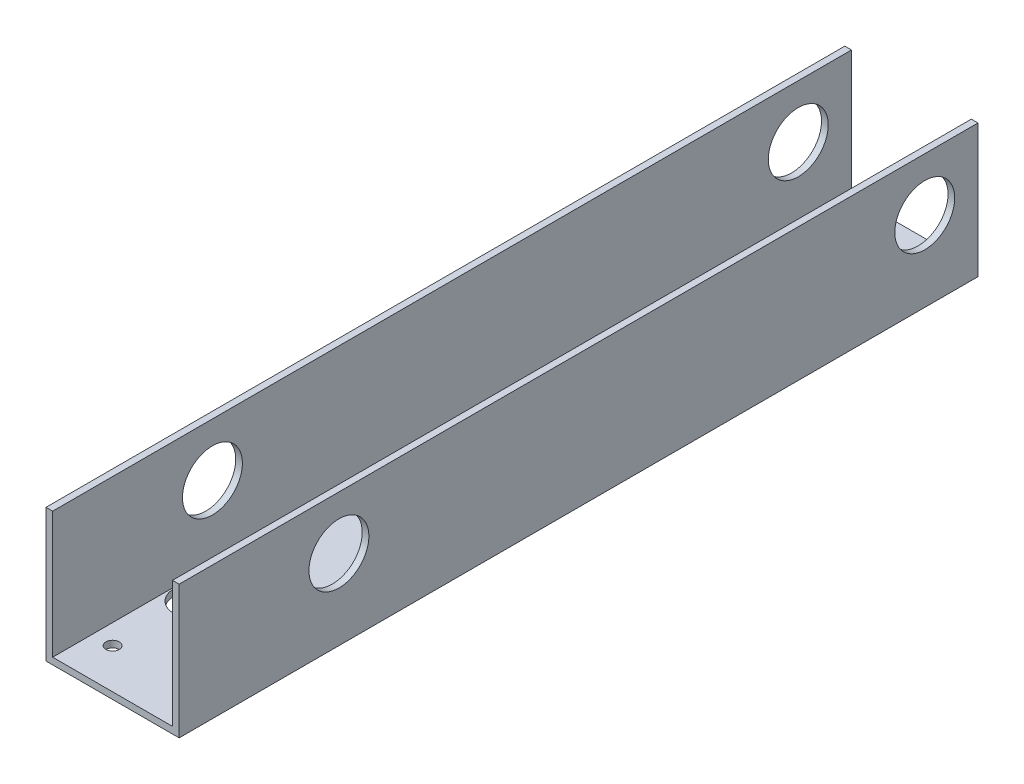
ISO-10303-21;
HEADER;
FILE_DESCRIPTION(('STEP AP214'),'2;1');
FILE_NAME('part.step','',(''),(''),'','','');
FILE_SCHEMA(('AUTOMOTIVE_DESIGN { 1 0 10303 214 1 1 1 1 }'));
ENDSEC;
DATA;
#1=APPLICATION_CONTEXT('core data for automotive mechanical design processes');
#2=APPLICATION_PROTOCOL_DEFINITION('international standard','automotive_design',2000,#1);
#3=PRODUCT_CONTEXT('',#1,'mechanical');
#4=PRODUCT('Part','Part','',(#3));
#5=PRODUCT_RELATED_PRODUCT_CATEGORY('part','',(#4));
#6=PRODUCT_DEFINITION_FORMATION('','',#4);
#7=PRODUCT_DEFINITION_CONTEXT('part definition',#1,'design');
#8=PRODUCT_DEFINITION('design','',#6,#7);
#9=PRODUCT_DEFINITION_SHAPE('','',#8);
#10=(LENGTH_UNIT() NAMED_UNIT(*) SI_UNIT(.MILLI.,.METRE.));
#11=(NAMED_UNIT(*) PLANE_ANGLE_UNIT() SI_UNIT($,.RADIAN.));
#12=(NAMED_UNIT(*) SI_UNIT($,.STERADIAN.) SOLID_ANGLE_UNIT());
#13=UNCERTAINTY_MEASURE_WITH_UNIT(LENGTH_MEASURE(1.E-05),#10,'distance_accuracy_value','');
#14=(GEOMETRIC_REPRESENTATION_CONTEXT(3) GLOBAL_UNCERTAINTY_ASSIGNED_CONTEXT((#13)) GLOBAL_UNIT_ASSIGNED_CONTEXT((#10,
#11,#12)) REPRESENTATION_CONTEXT('',''));
#15=CARTESIAN_POINT('',(0.,0.,0.));
#16=DIRECTION('',(0.,0.,1.));
#17=DIRECTION('',(1.,0.,0.));
#18=AXIS2_PLACEMENT_3D('',#15,#16,#17);
#19=CARTESIAN_POINT('',(0.,0.,381.));
#20=DIRECTION('',(1.,0.,0.));
#21=DIRECTION('',(0.,0.,-1.));
#22=AXIS2_PLACEMENT_3D('',#19,#20,#21);
#23=PLANE('',#22);
#24=CARTESIAN_POINT('',(0.,38.1,25.4));
#25=DIRECTION('',(-1.,0.,0.));
#26=DIRECTION('',(0.,0.,1.));
#27=AXIS2_PLACEMENT_3D('',#24,#25,#26);
#28=CIRCLE('',#27,14.2875);
#29=CARTESIAN_POINT('',(0.,38.1,39.6875));
#30=VERTEX_POINT('',#29);
#31=EDGE_CURVE('E310',#30,#30,#28,.T.);
#32=ORIENTED_EDGE('',*,*,#31,.F.);
#33=EDGE_LOOP('',(#32));
#34=FACE_BOUND('',#33,.T.);
#35=CARTESIAN_POINT('',(0.,38.1,304.8));
#36=DIRECTION('',(-1.,0.,0.));
#37=DIRECTION('',(0.,0.,1.));
#38=AXIS2_PLACEMENT_3D('',#35,#36,#37);
#39=CIRCLE('',#38,14.2875);
#40=CARTESIAN_POINT('',(0.,38.1,319.0875));
#41=VERTEX_POINT('',#40);
#42=EDGE_CURVE('E263',#41,#41,#39,.T.);
#43=ORIENTED_EDGE('',*,*,#42,.F.);
#44=EDGE_LOOP('',(#43));
#45=FACE_BOUND('',#44,.T.);
#46=DIRECTION('',(0.,-1.,0.));
#47=VECTOR('',#46,1.);
#48=CARTESIAN_POINT('',(0.,0.,0.));
#49=LINE('',#48,#47);
#50=CARTESIAN_POINT('',(0.,63.5,0.));
#51=VERTEX_POINT('',#50);
#52=CARTESIAN_POINT('',(0.,0.,0.));
#53=VERTEX_POINT('',#52);
#54=EDGE_CURVE('E171',#51,#53,#49,.T.);
#55=ORIENTED_EDGE('',*,*,#54,.T.);
#56=DIRECTION('',(0.,0.,-1.));
#57=VECTOR('',#56,1.);
#58=CARTESIAN_POINT('',(0.,0.,381.));
#59=LINE('',#58,#57);
#60=CARTESIAN_POINT('',(0.,0.,381.));
#61=VERTEX_POINT('',#60);
#62=EDGE_CURVE('E226',#61,#53,#59,.T.);
#63=ORIENTED_EDGE('',*,*,#62,.F.);
#64=DIRECTION('',(0.,-1.,0.));
#65=VECTOR('',#64,1.);
#66=CARTESIAN_POINT('',(0.,0.,381.));
#67=LINE('',#66,#65);
#68=CARTESIAN_POINT('',(0.,63.5,381.));
#69=VERTEX_POINT('',#68);
#70=EDGE_CURVE('E172',#69,#61,#67,.T.);
#71=ORIENTED_EDGE('',*,*,#70,.F.);
#72=DIRECTION('',(0.,0.,-1.));
#73=VECTOR('',#72,1.);
#74=CARTESIAN_POINT('',(0.,63.5,381.));
#75=LINE('',#74,#73);
#76=EDGE_CURVE('E190',#69,#51,#75,.T.);
#77=ORIENTED_EDGE('',*,*,#76,.T.);
#78=EDGE_LOOP('',(#55,#63,#71,#77));
#79=FACE_BOUND('',#78,.T.);
#80=ADVANCED_FACE('F33',(#34,#45,#79),#23,.F.);
#81=CARTESIAN_POINT('',(0.,0.,381.));
#82=DIRECTION('',(0.,1.,0.));
#83=DIRECTION('',(0.,0.,1.));
#84=AXIS2_PLACEMENT_3D('',#81,#82,#83);
#85=PLANE('',#84);
#86=CARTESIAN_POINT('',(38.735,0.,304.8));
#87=DIRECTION('',(0.,1.,0.));
#88=DIRECTION('',(0.,0.,1.));
#89=AXIS2_PLACEMENT_3D('',#86,#87,#88);
#90=CIRCLE('',#89,3.175);
#91=CARTESIAN_POINT('',(38.735,0.,307.975));
#92=VERTEX_POINT('',#91);
#93=EDGE_CURVE('E259',#92,#92,#90,.T.);
#94=ORIENTED_EDGE('',*,*,#93,.T.);
#95=EDGE_LOOP('',(#94));
#96=FACE_BOUND('',#95,.T.);
#97=CARTESIAN_POINT('',(53.975,0.,316.23));
#98=DIRECTION('',(0.,1.,0.));
#99=DIRECTION('',(0.,0.,1.));
#100=AXIS2_PLACEMENT_3D('',#97,#98,#99);
#101=CIRCLE('',#100,3.175);
#102=CARTESIAN_POINT('',(53.975,0.,319.405));
#103=VERTEX_POINT('',#102);
#104=EDGE_CURVE('E256',#103,#103,#101,.T.);
#105=ORIENTED_EDGE('',*,*,#104,.T.);
#106=EDGE_LOOP('',(#105));
#107=FACE_BOUND('',#106,.T.);
#108=CARTESIAN_POINT('',(53.975,0.,293.37));
#109=DIRECTION('',(0.,1.,0.));
#110=DIRECTION('',(0.,0.,1.));
#111=AXIS2_PLACEMENT_3D('',#108,#109,#110);
#112=CIRCLE('',#111,3.175);
#113=CARTESIAN_POINT('',(53.975,0.,296.545));
#114=VERTEX_POINT('',#113);
#115=EDGE_CURVE('E252',#114,#114,#112,.T.);
#116=ORIENTED_EDGE('',*,*,#115,.T.);
#117=EDGE_LOOP('',(#116));
#118=FACE_BOUND('',#117,.T.);
#119=DIRECTION('',(0.,0.,-1.));
#120=VECTOR('',#119,1.);
#121=CARTESIAN_POINT('',(3.80999999999999,0.,323.85));
#122=LINE('',#121,#120);
#123=CARTESIAN_POINT('',(3.80999999999999,0.,323.85));
#124=VERTEX_POINT('',#123);
#125=CARTESIAN_POINT('',(3.81,0.,285.75));
#126=VERTEX_POINT('',#125);
#127=EDGE_CURVE('E135',#124,#126,#122,.T.);
#128=ORIENTED_EDGE('',*,*,#127,.F.);
#129=CARTESIAN_POINT('',(13.97,0.,323.85));
#130=DIRECTION('',(0.,-1.,0.));
#131=DIRECTION('',(0.,0.,-1.));
#132=AXIS2_PLACEMENT_3D('',#129,#130,#131);
#133=CIRCLE('',#132,10.16);
#134=CARTESIAN_POINT('',(24.13,0.,323.85));
#135=VERTEX_POINT('',#134);
#136=EDGE_CURVE('E49',#135,#124,#133,.T.);
#137=ORIENTED_EDGE('',*,*,#136,.F.);
#138=DIRECTION('',(0.,0.,1.));
#139=VECTOR('',#138,1.);
#140=CARTESIAN_POINT('',(24.13,0.,323.85));
#141=LINE('',#140,#139);
#142=CARTESIAN_POINT('',(24.13,0.,285.75));
#143=VERTEX_POINT('',#142);
#144=EDGE_CURVE('E142',#143,#135,#141,.T.);
#145=ORIENTED_EDGE('',*,*,#144,.F.);
#146=CARTESIAN_POINT('',(13.97,0.,285.75));
#147=DIRECTION('',(0.,-1.,0.));
#148=DIRECTION('',(0.,0.,-1.));
#149=AXIS2_PLACEMENT_3D('',#146,#147,#148);
#150=CIRCLE('',#149,10.16);
#151=EDGE_CURVE('E126',#126,#143,#150,.T.);
#152=ORIENTED_EDGE('',*,*,#151,.F.);
#153=EDGE_LOOP('',(#128,#137,#145,#152));
#154=FACE_BOUND('',#153,.T.);
#155=CARTESIAN_POINT('',(50.8,0.,361.95));
#156=DIRECTION('',(0.,1.,0.));
#157=DIRECTION('',(0.,0.,1.));
#158=AXIS2_PLACEMENT_3D('',#155,#156,#157);
#159=CIRCLE('',#158,3.175);
#160=CARTESIAN_POINT('',(50.8,0.,365.125));
#161=VERTEX_POINT('',#160);
#162=EDGE_CURVE('E168',#161,#161,#159,.T.);
#163=ORIENTED_EDGE('',*,*,#162,.T.);
#164=EDGE_LOOP('',(#163));
#165=FACE_BOUND('',#164,.T.);
#166=CARTESIAN_POINT('',(12.7,0.,57.15));
#167=DIRECTION('',(0.,1.,0.));
#168=DIRECTION('',(0.,0.,1.));
#169=AXIS2_PLACEMENT_3D('',#166,#167,#168);
#170=CIRCLE('',#169,3.175);
#171=CARTESIAN_POINT('',(12.7,0.,60.325));
#172=VERTEX_POINT('',#171);
#173=EDGE_CURVE('E164',#172,#172,#170,.T.);
#174=ORIENTED_EDGE('',*,*,#173,.T.);
#175=EDGE_LOOP('',(#174));
#176=FACE_BOUND('',#175,.T.);
#177=CARTESIAN_POINT('',(12.7,0.,133.35));
#178=DIRECTION('',(0.,1.,0.));
#179=DIRECTION('',(0.,0.,1.));
#180=AXIS2_PLACEMENT_3D('',#177,#178,#179);
#181=CIRCLE('',#180,3.175);
#182=CARTESIAN_POINT('',(12.7,0.,136.525));
#183=VERTEX_POINT('',#182);
#184=EDGE_CURVE('E160',#183,#183,#181,.T.);
#185=ORIENTED_EDGE('',*,*,#184,.T.);
#186=EDGE_LOOP('',(#185));
#187=FACE_BOUND('',#186,.T.);
#188=CARTESIAN_POINT('',(12.7,0.,209.55));
#189=DIRECTION('',(0.,1.,0.));
#190=DIRECTION('',(0.,0.,1.));
#191=AXIS2_PLACEMENT_3D('',#188,#189,#190);
#192=CIRCLE('',#191,3.175);
#193=CARTESIAN_POINT('',(12.7,0.,212.725));
#194=VERTEX_POINT('',#193);
#195=EDGE_CURVE('E156',#194,#194,#192,.T.);
#196=ORIENTED_EDGE('',*,*,#195,.T.);
#197=EDGE_LOOP('',(#196));
#198=FACE_BOUND('',#197,.T.);
#199=CARTESIAN_POINT('',(12.7,0.,361.95));
#200=DIRECTION('',(0.,1.,0.));
#201=DIRECTION('',(0.,0.,1.));
#202=AXIS2_PLACEMENT_3D('',#199,#200,#201);
#203=CIRCLE('',#202,3.175);
#204=CARTESIAN_POINT('',(12.7,0.,365.125));
#205=VERTEX_POINT('',#204);
#206=EDGE_CURVE('E152',#205,#205,#203,.T.);
#207=ORIENTED_EDGE('',*,*,#206,.T.);
#208=EDGE_LOOP('',(#207));
#209=FACE_BOUND('',#208,.T.);
#210=DIRECTION('',(1.,0.,0.));
#211=VECTOR('',#210,1.);
#212=CARTESIAN_POINT('',(0.,0.,0.));
#213=LINE('',#212,#211);
#214=CARTESIAN_POINT('',(63.5,0.,0.));
#215=VERTEX_POINT('',#214);
#216=EDGE_CURVE('E193',#53,#215,#213,.T.);
#217=ORIENTED_EDGE('',*,*,#216,.T.);
#218=DIRECTION('',(0.,0.,-1.));
#219=VECTOR('',#218,1.);
#220=CARTESIAN_POINT('',(63.5,0.,381.));
#221=LINE('',#220,#219);
#222=CARTESIAN_POINT('',(63.5,0.,381.));
#223=VERTEX_POINT('',#222);
#224=EDGE_CURVE('E223',#223,#215,#221,.T.);
#225=ORIENTED_EDGE('',*,*,#224,.F.);
#226=DIRECTION('',(1.,0.,0.));
#227=VECTOR('',#226,1.);
#228=CARTESIAN_POINT('',(0.,0.,381.));
#229=LINE('',#228,#227);
#230=EDGE_CURVE('E175',#61,#223,#229,.T.);
#231=ORIENTED_EDGE('',*,*,#230,.F.);
#232=ORIENTED_EDGE('',*,*,#62,.T.);
#233=EDGE_LOOP('',(#217,#225,#231,#232));
#234=FACE_BOUND('',#233,.T.);
#235=ADVANCED_FACE('F139',(#96,#107,#118,#154,#165,#176,#187,#198,#209,#234),#85,.F.);
#236=CARTESIAN_POINT('',(63.5,63.5,381.));
#237=DIRECTION('',(-1.,0.,0.));
#238=DIRECTION('',(0.,-1.,0.));
#239=AXIS2_PLACEMENT_3D('',#236,#237,#238);
#240=PLANE('',#239);
#241=CARTESIAN_POINT('',(63.5,38.1,25.4));
#242=DIRECTION('',(-1.,0.,0.));
#243=DIRECTION('',(0.,-1.,0.));
#244=AXIS2_PLACEMENT_3D('',#241,#242,#243);
#245=CIRCLE('',#244,14.2875);
#246=CARTESIAN_POINT('',(63.5,23.8125,25.4));
#247=VERTEX_POINT('',#246);
#248=EDGE_CURVE('E253',#247,#247,#245,.T.);
#249=ORIENTED_EDGE('',*,*,#248,.T.);
#250=EDGE_LOOP('',(#249));
#251=FACE_BOUND('',#250,.T.);
#252=CARTESIAN_POINT('',(63.5,38.1,304.8));
#253=DIRECTION('',(-1.,0.,0.));
#254=DIRECTION('',(0.,0.,1.));
#255=AXIS2_PLACEMENT_3D('',#252,#253,#254);
#256=CIRCLE('',#255,14.2875);
#257=CARTESIAN_POINT('',(63.5,38.1,319.0875));
#258=VERTEX_POINT('',#257);
#259=EDGE_CURVE('E248',#258,#258,#256,.T.);
#260=ORIENTED_EDGE('',*,*,#259,.T.);
#261=EDGE_LOOP('',(#260));
#262=FACE_BOUND('',#261,.T.);
#263=DIRECTION('',(0.,1.,0.));
#264=VECTOR('',#263,1.);
#265=CARTESIAN_POINT('',(63.5,63.5,0.));
#266=LINE('',#265,#264);
#267=CARTESIAN_POINT('',(63.5,63.5,0.));
#268=VERTEX_POINT('',#267);
#269=EDGE_CURVE('E195',#215,#268,#266,.T.);
#270=ORIENTED_EDGE('',*,*,#269,.T.);
#271=DIRECTION('',(0.,0.,-1.));
#272=VECTOR('',#271,1.);
#273=CARTESIAN_POINT('',(63.5,63.5,381.));
#274=LINE('',#273,#272);
#275=CARTESIAN_POINT('',(63.5,63.5,381.));
#276=VERTEX_POINT('',#275);
#277=EDGE_CURVE('E220',#276,#268,#274,.T.);
#278=ORIENTED_EDGE('',*,*,#277,.F.);
#279=DIRECTION('',(0.,1.,0.));
#280=VECTOR('',#279,1.);
#281=CARTESIAN_POINT('',(63.5,63.5,381.));
#282=LINE('',#281,#280);
#283=EDGE_CURVE('E178',#223,#276,#282,.T.);
#284=ORIENTED_EDGE('',*,*,#283,.F.);
#285=ORIENTED_EDGE('',*,*,#224,.T.);
#286=EDGE_LOOP('',(#270,#278,#284,#285));
#287=FACE_BOUND('',#286,.T.);
#288=ADVANCED_FACE('F305',(#251,#262,#287),#240,.F.);
#289=CARTESIAN_POINT('',(60.325,63.5,381.));
#290=DIRECTION('',(0.,-1.,0.));
#291=DIRECTION('',(0.,0.,-1.));
#292=AXIS2_PLACEMENT_3D('',#289,#290,#291);
#293=PLANE('',#292);
#294=DIRECTION('',(-1.,0.,0.));
#295=VECTOR('',#294,1.);
#296=CARTESIAN_POINT('',(60.325,63.5,0.));
#297=LINE('',#296,#295);
#298=CARTESIAN_POINT('',(60.325,63.5,0.));
#299=VERTEX_POINT('',#298);
#300=EDGE_CURVE('E197',#268,#299,#297,.T.);
#301=ORIENTED_EDGE('',*,*,#300,.T.);
#302=DIRECTION('',(0.,0.,-1.));
#303=VECTOR('',#302,1.);
#304=CARTESIAN_POINT('',(60.325,63.5,381.));
#305=LINE('',#304,#303);
#306=CARTESIAN_POINT('',(60.325,63.5,381.));
#307=VERTEX_POINT('',#306);
#308=EDGE_CURVE('E217',#307,#299,#305,.T.);
#309=ORIENTED_EDGE('',*,*,#308,.F.);
#310=DIRECTION('',(-1.,0.,0.));
#311=VECTOR('',#310,1.);
#312=CARTESIAN_POINT('',(60.325,63.5,381.));
#313=LINE('',#312,#311);
#314=EDGE_CURVE('E180',#276,#307,#313,.T.);
#315=ORIENTED_EDGE('',*,*,#314,.F.);
#316=ORIENTED_EDGE('',*,*,#277,.T.);
#317=EDGE_LOOP('',(#301,#309,#315,#316));
#318=FACE_BOUND('',#317,.T.);
#319=ADVANCED_FACE('F346',(#318),#293,.F.);
#320=CARTESIAN_POINT('',(60.325,3.175,381.));
#321=DIRECTION('',(1.,0.,0.));
#322=DIRECTION('',(0.,0.,-1.));
#323=AXIS2_PLACEMENT_3D('',#320,#321,#322);
#324=PLANE('',#323);
#325=CARTESIAN_POINT('',(60.325,38.1,25.4));
#326=DIRECTION('',(1.,0.,0.));
#327=DIRECTION('',(0.,0.,-1.));
#328=AXIS2_PLACEMENT_3D('',#325,#326,#327);
#329=CIRCLE('',#328,14.2875);
#330=CARTESIAN_POINT('',(60.325,38.1,11.1125));
#331=VERTEX_POINT('',#330);
#332=EDGE_CURVE('E507',#331,#331,#329,.T.);
#333=ORIENTED_EDGE('',*,*,#332,.T.);
#334=EDGE_LOOP('',(#333));
#335=FACE_BOUND('',#334,.T.);
#336=CARTESIAN_POINT('',(60.325,38.1,304.8));
#337=DIRECTION('',(1.,0.,0.));
#338=DIRECTION('',(0.,0.,-1.));
#339=AXIS2_PLACEMENT_3D('',#336,#337,#338);
#340=CIRCLE('',#339,14.2875);
#341=CARTESIAN_POINT('',(60.325,38.1,290.5125));
#342=VERTEX_POINT('',#341);
#343=EDGE_CURVE('E247',#342,#342,#340,.T.);
#344=ORIENTED_EDGE('',*,*,#343,.T.);
#345=EDGE_LOOP('',(#344));
#346=FACE_BOUND('',#345,.T.);
#347=DIRECTION('',(0.,-1.,0.));
#348=VECTOR('',#347,1.);
#349=CARTESIAN_POINT('',(60.325,3.175,0.));
#350=LINE('',#349,#348);
#351=CARTESIAN_POINT('',(60.325,3.175,0.));
#352=VERTEX_POINT('',#351);
#353=EDGE_CURVE('E199',#299,#352,#350,.T.);
#354=ORIENTED_EDGE('',*,*,#353,.T.);
#355=DIRECTION('',(0.,0.,-1.));
#356=VECTOR('',#355,1.);
#357=CARTESIAN_POINT('',(60.325,3.175,381.));
#358=LINE('',#357,#356);
#359=CARTESIAN_POINT('',(60.325,3.175,381.));
#360=VERTEX_POINT('',#359);
#361=EDGE_CURVE('E214',#360,#352,#358,.T.);
#362=ORIENTED_EDGE('',*,*,#361,.F.);
#363=DIRECTION('',(0.,-1.,0.));
#364=VECTOR('',#363,1.);
#365=CARTESIAN_POINT('',(60.325,3.175,381.));
#366=LINE('',#365,#364);
#367=EDGE_CURVE('E182',#307,#360,#366,.T.);
#368=ORIENTED_EDGE('',*,*,#367,.F.);
#369=ORIENTED_EDGE('',*,*,#308,.T.);
#370=EDGE_LOOP('',(#354,#362,#368,#369));
#371=FACE_BOUND('',#370,.T.);
#372=ADVANCED_FACE('F279',(#335,#346,#371),#324,.F.);
#373=CARTESIAN_POINT('',(3.17500000000001,3.175,381.));
#374=DIRECTION('',(0.,-1.,0.));
#375=DIRECTION('',(1.,0.,0.));
#376=AXIS2_PLACEMENT_3D('',#373,#374,#375);
#377=PLANE('',#376);
#378=CARTESIAN_POINT('',(38.735,3.175,304.8));
#379=DIRECTION('',(0.,-1.,0.));
#380=DIRECTION('',(1.,0.,0.));
#381=AXIS2_PLACEMENT_3D('',#378,#379,#380);
#382=CIRCLE('',#381,3.175);
#383=CARTESIAN_POINT('',(41.91,3.175,304.8));
#384=VERTEX_POINT('',#383);
#385=EDGE_CURVE('E257',#384,#384,#382,.T.);
#386=ORIENTED_EDGE('',*,*,#385,.T.);
#387=EDGE_LOOP('',(#386));
#388=FACE_BOUND('',#387,.T.);
#389=CARTESIAN_POINT('',(53.975,3.175,316.23));
#390=DIRECTION('',(0.,-1.,0.));
#391=DIRECTION('',(1.,0.,0.));
#392=AXIS2_PLACEMENT_3D('',#389,#390,#391);
#393=CIRCLE('',#392,3.175);
#394=CARTESIAN_POINT('',(57.15,3.175,316.23));
#395=VERTEX_POINT('',#394);
#396=EDGE_CURVE('E254',#395,#395,#393,.T.);
#397=ORIENTED_EDGE('',*,*,#396,.T.);
#398=EDGE_LOOP('',(#397));
#399=FACE_BOUND('',#398,.T.);
#400=CARTESIAN_POINT('',(53.975,3.175,293.37));
#401=DIRECTION('',(0.,-1.,0.));
#402=DIRECTION('',(1.,0.,0.));
#403=AXIS2_PLACEMENT_3D('',#400,#401,#402);
#404=CIRCLE('',#403,3.175);
#405=CARTESIAN_POINT('',(57.15,3.175,293.37));
#406=VERTEX_POINT('',#405);
#407=EDGE_CURVE('E249',#406,#406,#404,.T.);
#408=ORIENTED_EDGE('',*,*,#407,.T.);
#409=EDGE_LOOP('',(#408));
#410=FACE_BOUND('',#409,.T.);
#411=DIRECTION('',(0.,0.,1.));
#412=VECTOR('',#411,1.);
#413=CARTESIAN_POINT('',(24.13,3.175,381.));
#414=LINE('',#413,#412);
#415=CARTESIAN_POINT('',(24.13,3.175,285.75));
#416=VERTEX_POINT('',#415);
#417=CARTESIAN_POINT('',(24.13,3.175,323.85));
#418=VERTEX_POINT('',#417);
#419=EDGE_CURVE('E41',#416,#418,#414,.T.);
#420=ORIENTED_EDGE('',*,*,#419,.T.);
#421=CARTESIAN_POINT('',(13.97,3.175,323.85));
#422=DIRECTION('',(0.,-1.,0.));
#423=DIRECTION('',(1.,0.,0.));
#424=AXIS2_PLACEMENT_3D('',#421,#422,#423);
#425=CIRCLE('',#424,10.16);
#426=CARTESIAN_POINT('',(3.80999999999999,3.175,323.85));
#427=VERTEX_POINT('',#426);
#428=EDGE_CURVE('E11',#418,#427,#425,.T.);
#429=ORIENTED_EDGE('',*,*,#428,.T.);
#430=DIRECTION('',(0.,0.,-1.));
#431=VECTOR('',#430,1.);
#432=CARTESIAN_POINT('',(3.80999999999999,3.175,381.));
#433=LINE('',#432,#431);
#434=CARTESIAN_POINT('',(3.81,3.175,285.75));
#435=VERTEX_POINT('',#434);
#436=EDGE_CURVE('E229',#427,#435,#433,.T.);
#437=ORIENTED_EDGE('',*,*,#436,.T.);
#438=CARTESIAN_POINT('',(13.97,3.175,285.75));
#439=DIRECTION('',(0.,-1.,0.));
#440=DIRECTION('',(1.,0.,0.));
#441=AXIS2_PLACEMENT_3D('',#438,#439,#440);
#442=CIRCLE('',#441,10.16);
#443=EDGE_CURVE('E129',#435,#416,#442,.T.);
#444=ORIENTED_EDGE('',*,*,#443,.T.);
#445=EDGE_LOOP('',(#420,#429,#437,#444));
#446=FACE_BOUND('',#445,.T.);
#447=CARTESIAN_POINT('',(50.8,3.175,361.95));
#448=DIRECTION('',(0.,-1.,0.));
#449=DIRECTION('',(1.,0.,0.));
#450=AXIS2_PLACEMENT_3D('',#447,#448,#449);
#451=CIRCLE('',#450,3.175);
#452=CARTESIAN_POINT('',(53.975,3.175,361.95));
#453=VERTEX_POINT('',#452);
#454=EDGE_CURVE('E167',#453,#453,#451,.T.);
#455=ORIENTED_EDGE('',*,*,#454,.T.);
#456=EDGE_LOOP('',(#455));
#457=FACE_BOUND('',#456,.T.);
#458=CARTESIAN_POINT('',(12.7,3.175,57.15));
#459=DIRECTION('',(0.,-1.,0.));
#460=DIRECTION('',(1.,0.,0.));
#461=AXIS2_PLACEMENT_3D('',#458,#459,#460);
#462=CIRCLE('',#461,3.175);
#463=CARTESIAN_POINT('',(15.875,3.175,57.15));
#464=VERTEX_POINT('',#463);
#465=EDGE_CURVE('E163',#464,#464,#462,.T.);
#466=ORIENTED_EDGE('',*,*,#465,.T.);
#467=EDGE_LOOP('',(#466));
#468=FACE_BOUND('',#467,.T.);
#469=CARTESIAN_POINT('',(12.7,3.175,133.35));
#470=DIRECTION('',(0.,-1.,0.));
#471=DIRECTION('',(1.,0.,0.));
#472=AXIS2_PLACEMENT_3D('',#469,#470,#471);
#473=CIRCLE('',#472,3.175);
#474=CARTESIAN_POINT('',(15.875,3.175,133.35));
#475=VERTEX_POINT('',#474);
#476=EDGE_CURVE('E159',#475,#475,#473,.T.);
#477=ORIENTED_EDGE('',*,*,#476,.T.);
#478=EDGE_LOOP('',(#477));
#479=FACE_BOUND('',#478,.T.);
#480=CARTESIAN_POINT('',(12.7,3.175,209.55));
#481=DIRECTION('',(0.,-1.,0.));
#482=DIRECTION('',(1.,0.,0.));
#483=AXIS2_PLACEMENT_3D('',#480,#481,#482);
#484=CIRCLE('',#483,3.175);
#485=CARTESIAN_POINT('',(15.875,3.175,209.55));
#486=VERTEX_POINT('',#485);
#487=EDGE_CURVE('E155',#486,#486,#484,.T.);
#488=ORIENTED_EDGE('',*,*,#487,.T.);
#489=EDGE_LOOP('',(#488));
#490=FACE_BOUND('',#489,.T.);
#491=CARTESIAN_POINT('',(12.7,3.175,361.95));
#492=DIRECTION('',(0.,-1.,0.));
#493=DIRECTION('',(1.,0.,0.));
#494=AXIS2_PLACEMENT_3D('',#491,#492,#493);
#495=CIRCLE('',#494,3.175);
#496=CARTESIAN_POINT('',(15.875,3.175,361.95));
#497=VERTEX_POINT('',#496);
#498=EDGE_CURVE('E149',#497,#497,#495,.T.);
#499=ORIENTED_EDGE('',*,*,#498,.T.);
#500=EDGE_LOOP('',(#499));
#501=FACE_BOUND('',#500,.T.);
#502=DIRECTION('',(-1.,0.,0.));
#503=VECTOR('',#502,1.);
#504=CARTESIAN_POINT('',(3.17500000000001,3.175,0.));
#505=LINE('',#504,#503);
#506=CARTESIAN_POINT('',(3.17500000000001,3.175,0.));
#507=VERTEX_POINT('',#506);
#508=EDGE_CURVE('E201',#352,#507,#505,.T.);
#509=ORIENTED_EDGE('',*,*,#508,.T.);
#510=DIRECTION('',(0.,0.,-1.));
#511=VECTOR('',#510,1.);
#512=CARTESIAN_POINT('',(3.17500000000001,3.175,381.));
#513=LINE('',#512,#511);
#514=CARTESIAN_POINT('',(3.17500000000001,3.175,381.));
#515=VERTEX_POINT('',#514);
#516=EDGE_CURVE('E211',#515,#507,#513,.T.);
#517=ORIENTED_EDGE('',*,*,#516,.F.);
#518=DIRECTION('',(-1.,0.,0.));
#519=VECTOR('',#518,1.);
#520=CARTESIAN_POINT('',(3.17500000000001,3.175,381.));
#521=LINE('',#520,#519);
#522=EDGE_CURVE('E184',#360,#515,#521,.T.);
#523=ORIENTED_EDGE('',*,*,#522,.F.);
#524=ORIENTED_EDGE('',*,*,#361,.T.);
#525=EDGE_LOOP('',(#509,#517,#523,#524));
#526=FACE_BOUND('',#525,.T.);
#527=ADVANCED_FACE('F339',(#388,#399,#410,#446,#457,#468,#479,#490,#501,#526),#377,.F.);
#528=CARTESIAN_POINT('',(3.175,63.5,381.));
#529=DIRECTION('',(-1.,0.,0.));
#530=DIRECTION('',(0.,-1.,0.));
#531=AXIS2_PLACEMENT_3D('',#528,#529,#530);
#532=PLANE('',#531);
#533=CARTESIAN_POINT('',(3.17500000000001,38.1,25.4));
#534=DIRECTION('',(-1.,0.,0.));
#535=DIRECTION('',(0.,-1.,0.));
#536=AXIS2_PLACEMENT_3D('',#533,#534,#535);
#537=CIRCLE('',#536,14.2875);
#538=CARTESIAN_POINT('',(3.17500000000001,23.8125,25.4));
#539=VERTEX_POINT('',#538);
#540=EDGE_CURVE('E36',#539,#539,#537,.T.);
#541=ORIENTED_EDGE('',*,*,#540,.T.);
#542=EDGE_LOOP('',(#541));
#543=FACE_BOUND('',#542,.T.);
#544=CARTESIAN_POINT('',(3.175,38.1,304.8));
#545=DIRECTION('',(-1.,0.,0.));
#546=DIRECTION('',(0.,-1.,0.));
#547=AXIS2_PLACEMENT_3D('',#544,#545,#546);
#548=CIRCLE('',#547,14.2875);
#549=CARTESIAN_POINT('',(3.175,23.8125,304.8));
#550=VERTEX_POINT('',#549);
#551=EDGE_CURVE('E244',#550,#550,#548,.T.);
#552=ORIENTED_EDGE('',*,*,#551,.T.);
#553=EDGE_LOOP('',(#552));
#554=FACE_BOUND('',#553,.T.);
#555=DIRECTION('',(0.,1.,0.));
#556=VECTOR('',#555,1.);
#557=CARTESIAN_POINT('',(3.175,63.5,0.));
#558=LINE('',#557,#556);
#559=CARTESIAN_POINT('',(3.175,63.5,0.));
#560=VERTEX_POINT('',#559);
#561=EDGE_CURVE('E203',#507,#560,#558,.T.);
#562=ORIENTED_EDGE('',*,*,#561,.T.);
#563=DIRECTION('',(0.,0.,-1.));
#564=VECTOR('',#563,1.);
#565=CARTESIAN_POINT('',(3.175,63.5,381.));
#566=LINE('',#565,#564);
#567=CARTESIAN_POINT('',(3.175,63.5,381.));
#568=VERTEX_POINT('',#567);
#569=EDGE_CURVE('E208',#568,#560,#566,.T.);
#570=ORIENTED_EDGE('',*,*,#569,.F.);
#571=DIRECTION('',(0.,1.,0.));
#572=VECTOR('',#571,1.);
#573=CARTESIAN_POINT('',(3.175,63.5,381.));
#574=LINE('',#573,#572);
#575=EDGE_CURVE('E186',#515,#568,#574,.T.);
#576=ORIENTED_EDGE('',*,*,#575,.F.);
#577=ORIENTED_EDGE('',*,*,#516,.T.);
#578=EDGE_LOOP('',(#562,#570,#576,#577));
#579=FACE_BOUND('',#578,.T.);
#580=ADVANCED_FACE('F334',(#543,#554,#579),#532,.F.);
#581=CARTESIAN_POINT('',(0.,63.5,381.));
#582=DIRECTION('',(0.,-1.,0.));
#583=DIRECTION('',(0.,0.,-1.));
#584=AXIS2_PLACEMENT_3D('',#581,#582,#583);
#585=PLANE('',#584);
#586=DIRECTION('',(-1.,0.,0.));
#587=VECTOR('',#586,1.);
#588=CARTESIAN_POINT('',(0.,63.5,0.));
#589=LINE('',#588,#587);
#590=EDGE_CURVE('E176',#560,#51,#589,.T.);
#591=ORIENTED_EDGE('',*,*,#590,.T.);
#592=ORIENTED_EDGE('',*,*,#76,.F.);
#593=DIRECTION('',(-1.,0.,0.));
#594=VECTOR('',#593,1.);
#595=CARTESIAN_POINT('',(0.,63.5,381.));
#596=LINE('',#595,#594);
#597=EDGE_CURVE('E188',#568,#69,#596,.T.);
#598=ORIENTED_EDGE('',*,*,#597,.F.);
#599=ORIENTED_EDGE('',*,*,#569,.T.);
#600=EDGE_LOOP('',(#591,#592,#598,#599));
#601=FACE_BOUND('',#600,.T.);
#602=ADVANCED_FACE('F332',(#601),#585,.F.);
#603=CARTESIAN_POINT('',(0.,0.,381.));
#604=DIRECTION('',(0.,0.,-1.));
#605=DIRECTION('',(-1.,0.,0.));
#606=AXIS2_PLACEMENT_3D('',#603,#604,#605);
#607=PLANE('',#606);
#608=ORIENTED_EDGE('',*,*,#70,.T.);
#609=ORIENTED_EDGE('',*,*,#230,.T.);
#610=ORIENTED_EDGE('',*,*,#283,.T.);
#611=ORIENTED_EDGE('',*,*,#314,.T.);
#612=ORIENTED_EDGE('',*,*,#367,.T.);
#613=ORIENTED_EDGE('',*,*,#522,.T.);
#614=ORIENTED_EDGE('',*,*,#575,.T.);
#615=ORIENTED_EDGE('',*,*,#597,.T.);
#616=EDGE_LOOP('',(#608,#609,#610,#611,#612,#613,#614,#615));
#617=FACE_BOUND('',#616,.T.);
#618=ADVANCED_FACE('F327',(#617),#607,.F.);
#619=CARTESIAN_POINT('',(0.,0.,0.));
#620=DIRECTION('',(0.,0.,-1.));
#621=DIRECTION('',(-1.,0.,0.));
#622=AXIS2_PLACEMENT_3D('',#619,#620,#621);
#623=PLANE('',#622);
#624=ORIENTED_EDGE('',*,*,#54,.F.);
#625=ORIENTED_EDGE('',*,*,#590,.F.);
#626=ORIENTED_EDGE('',*,*,#561,.F.);
#627=ORIENTED_EDGE('',*,*,#508,.F.);
#628=ORIENTED_EDGE('',*,*,#353,.F.);
#629=ORIENTED_EDGE('',*,*,#300,.F.);
#630=ORIENTED_EDGE('',*,*,#269,.F.);
#631=ORIENTED_EDGE('',*,*,#216,.F.);
#632=EDGE_LOOP('',(#624,#625,#626,#627,#628,#629,#630,#631));
#633=FACE_BOUND('',#632,.T.);
#634=ADVANCED_FACE('F319',(#633),#623,.T.);
#635=CARTESIAN_POINT('',(12.7,63.5,361.95));
#636=DIRECTION('',(0.,-1.,0.));
#637=DIRECTION('',(0.,0.,-1.));
#638=AXIS2_PLACEMENT_3D('',#635,#636,#637);
#639=CYLINDRICAL_SURFACE('',#638,3.175);
#640=ORIENTED_EDGE('',*,*,#498,.F.);
#641=EDGE_LOOP('',(#640));
#642=FACE_BOUND('',#641,.T.);
#643=ORIENTED_EDGE('',*,*,#206,.F.);
#644=EDGE_LOOP('',(#643));
#645=FACE_BOUND('',#644,.T.);
#646=ADVANCED_FACE('F370',(#642,#645),#639,.F.);
#647=CARTESIAN_POINT('',(12.7,63.5,209.55));
#648=DIRECTION('',(0.,-1.,0.));
#649=DIRECTION('',(0.,0.,-1.));
#650=AXIS2_PLACEMENT_3D('',#647,#648,#649);
#651=CYLINDRICAL_SURFACE('',#650,3.175);
#652=ORIENTED_EDGE('',*,*,#487,.F.);
#653=EDGE_LOOP('',(#652));
#654=FACE_BOUND('',#653,.T.);
#655=ORIENTED_EDGE('',*,*,#195,.F.);
#656=EDGE_LOOP('',(#655));
#657=FACE_BOUND('',#656,.T.);
#658=ADVANCED_FACE('F375',(#654,#657),#651,.F.);
#659=CARTESIAN_POINT('',(12.7,63.5,133.35));
#660=DIRECTION('',(0.,-1.,0.));
#661=DIRECTION('',(0.,0.,-1.));
#662=AXIS2_PLACEMENT_3D('',#659,#660,#661);
#663=CYLINDRICAL_SURFACE('',#662,3.175);
#664=ORIENTED_EDGE('',*,*,#476,.F.);
#665=EDGE_LOOP('',(#664));
#666=FACE_BOUND('',#665,.T.);
#667=ORIENTED_EDGE('',*,*,#184,.F.);
#668=EDGE_LOOP('',(#667));
#669=FACE_BOUND('',#668,.T.);
#670=ADVANCED_FACE('F381',(#666,#669),#663,.F.);
#671=CARTESIAN_POINT('',(12.7,63.5,57.15));
#672=DIRECTION('',(0.,-1.,0.));
#673=DIRECTION('',(0.,0.,-1.));
#674=AXIS2_PLACEMENT_3D('',#671,#672,#673);
#675=CYLINDRICAL_SURFACE('',#674,3.175);
#676=ORIENTED_EDGE('',*,*,#465,.F.);
#677=EDGE_LOOP('',(#676));
#678=FACE_BOUND('',#677,.T.);
#679=ORIENTED_EDGE('',*,*,#173,.F.);
#680=EDGE_LOOP('',(#679));
#681=FACE_BOUND('',#680,.T.);
#682=ADVANCED_FACE('F377',(#678,#681),#675,.F.);
#683=CARTESIAN_POINT('',(50.8,63.5,361.95));
#684=DIRECTION('',(0.,-1.,0.));
#685=DIRECTION('',(0.,0.,-1.));
#686=AXIS2_PLACEMENT_3D('',#683,#684,#685);
#687=CYLINDRICAL_SURFACE('',#686,3.175);
#688=ORIENTED_EDGE('',*,*,#454,.F.);
#689=EDGE_LOOP('',(#688));
#690=FACE_BOUND('',#689,.T.);
#691=ORIENTED_EDGE('',*,*,#162,.F.);
#692=EDGE_LOOP('',(#691));
#693=FACE_BOUND('',#692,.T.);
#694=ADVANCED_FACE('F380',(#690,#693),#687,.F.);
#695=CARTESIAN_POINT('',(13.97,12.7,323.85));
#696=DIRECTION('',(0.,-1.,0.));
#697=DIRECTION('',(0.,0.,-1.));
#698=AXIS2_PLACEMENT_3D('',#695,#696,#697);
#699=CYLINDRICAL_SURFACE('',#698,10.16);
#700=DIRECTION('',(0.,-1.,0.));
#701=VECTOR('',#700,1.);
#702=CARTESIAN_POINT('',(24.13,12.7,323.85));
#703=LINE('',#702,#701);
#704=EDGE_CURVE('E147',#418,#135,#703,.T.);
#705=ORIENTED_EDGE('',*,*,#704,.T.);
#706=ORIENTED_EDGE('',*,*,#136,.T.);
#707=DIRECTION('',(0.,-1.,0.));
#708=VECTOR('',#707,1.);
#709=CARTESIAN_POINT('',(3.80999999999999,12.7,323.85));
#710=LINE('',#709,#708);
#711=EDGE_CURVE('E132',#427,#124,#710,.T.);
#712=ORIENTED_EDGE('',*,*,#711,.F.);
#713=ORIENTED_EDGE('',*,*,#428,.F.);
#714=EDGE_LOOP('',(#705,#706,#712,#713));
#715=FACE_BOUND('',#714,.T.);
#716=ADVANCED_FACE('F385',(#715),#699,.F.);
#717=CARTESIAN_POINT('',(24.13,12.7,323.85));
#718=DIRECTION('',(1.,0.,0.));
#719=DIRECTION('',(0.,0.,-1.));
#720=AXIS2_PLACEMENT_3D('',#717,#718,#719);
#721=PLANE('',#720);
#722=DIRECTION('',(0.,-1.,0.));
#723=VECTOR('',#722,1.);
#724=CARTESIAN_POINT('',(24.13,12.7,285.75));
#725=LINE('',#724,#723);
#726=EDGE_CURVE('E131',#416,#143,#725,.T.);
#727=ORIENTED_EDGE('',*,*,#726,.T.);
#728=ORIENTED_EDGE('',*,*,#144,.T.);
#729=ORIENTED_EDGE('',*,*,#704,.F.);
#730=ORIENTED_EDGE('',*,*,#419,.F.);
#731=EDGE_LOOP('',(#727,#728,#729,#730));
#732=FACE_BOUND('',#731,.T.);
#733=ADVANCED_FACE('F395',(#732),#721,.F.);
#734=CARTESIAN_POINT('',(13.97,12.7,285.75));
#735=DIRECTION('',(0.,-1.,0.));
#736=DIRECTION('',(0.,0.,-1.));
#737=AXIS2_PLACEMENT_3D('',#734,#735,#736);
#738=CYLINDRICAL_SURFACE('',#737,10.16);
#739=DIRECTION('',(0.,-1.,0.));
#740=VECTOR('',#739,1.);
#741=CARTESIAN_POINT('',(3.81,12.7,285.75));
#742=LINE('',#741,#740);
#743=EDGE_CURVE('E57',#435,#126,#742,.T.);
#744=ORIENTED_EDGE('',*,*,#743,.T.);
#745=ORIENTED_EDGE('',*,*,#151,.T.);
#746=ORIENTED_EDGE('',*,*,#726,.F.);
#747=ORIENTED_EDGE('',*,*,#443,.F.);
#748=EDGE_LOOP('',(#744,#745,#746,#747));
#749=FACE_BOUND('',#748,.T.);
#750=ADVANCED_FACE('F123',(#749),#738,.F.);
#751=CARTESIAN_POINT('',(3.80999999999999,12.7,323.85));
#752=DIRECTION('',(-1.,0.,0.));
#753=DIRECTION('',(0.,0.,1.));
#754=AXIS2_PLACEMENT_3D('',#751,#752,#753);
#755=PLANE('',#754);
#756=ORIENTED_EDGE('',*,*,#711,.T.);
#757=ORIENTED_EDGE('',*,*,#127,.T.);
#758=ORIENTED_EDGE('',*,*,#743,.F.);
#759=ORIENTED_EDGE('',*,*,#436,.F.);
#760=EDGE_LOOP('',(#756,#757,#758,#759));
#761=FACE_BOUND('',#760,.T.);
#762=ADVANCED_FACE('F136',(#761),#755,.F.);
#763=CARTESIAN_POINT('',(63.5,38.1,304.8));
#764=DIRECTION('',(-1.,0.,0.));
#765=DIRECTION('',(0.,0.,1.));
#766=AXIS2_PLACEMENT_3D('',#763,#764,#765);
#767=CYLINDRICAL_SURFACE('',#766,14.2875);
#768=ORIENTED_EDGE('',*,*,#42,.T.);
#769=EDGE_LOOP('',(#768));
#770=FACE_BOUND('',#769,.T.);
#771=ORIENTED_EDGE('',*,*,#551,.F.);
#772=EDGE_LOOP('',(#771));
#773=FACE_BOUND('',#772,.T.);
#774=ADVANCED_FACE('F285',(#770,#773),#767,.F.);
#775=ORIENTED_EDGE('',*,*,#259,.F.);
#776=EDGE_LOOP('',(#775));
#777=FACE_BOUND('',#776,.T.);
#778=ORIENTED_EDGE('',*,*,#343,.F.);
#779=EDGE_LOOP('',(#778));
#780=FACE_BOUND('',#779,.T.);
#781=ADVANCED_FACE('F282',(#777,#780),#767,.F.);
#782=CARTESIAN_POINT('',(53.975,63.5,293.37));
#783=DIRECTION('',(0.,-1.,0.));
#784=DIRECTION('',(0.,0.,-1.));
#785=AXIS2_PLACEMENT_3D('',#782,#783,#784);
#786=CYLINDRICAL_SURFACE('',#785,3.175);
#787=ORIENTED_EDGE('',*,*,#407,.F.);
#788=EDGE_LOOP('',(#787));
#789=FACE_BOUND('',#788,.T.);
#790=ORIENTED_EDGE('',*,*,#115,.F.);
#791=EDGE_LOOP('',(#790));
#792=FACE_BOUND('',#791,.T.);
#793=ADVANCED_FACE('F284',(#789,#792),#786,.F.);
#794=CARTESIAN_POINT('',(53.975,63.5,316.23));
#795=DIRECTION('',(0.,-1.,0.));
#796=DIRECTION('',(0.,0.,-1.));
#797=AXIS2_PLACEMENT_3D('',#794,#795,#796);
#798=CYLINDRICAL_SURFACE('',#797,3.175);
#799=ORIENTED_EDGE('',*,*,#396,.F.);
#800=EDGE_LOOP('',(#799));
#801=FACE_BOUND('',#800,.T.);
#802=ORIENTED_EDGE('',*,*,#104,.F.);
#803=EDGE_LOOP('',(#802));
#804=FACE_BOUND('',#803,.T.);
#805=ADVANCED_FACE('F292',(#801,#804),#798,.F.);
#806=CARTESIAN_POINT('',(38.735,63.5,304.8));
#807=DIRECTION('',(0.,-1.,0.));
#808=DIRECTION('',(0.,0.,-1.));
#809=AXIS2_PLACEMENT_3D('',#806,#807,#808);
#810=CYLINDRICAL_SURFACE('',#809,3.175);
#811=ORIENTED_EDGE('',*,*,#385,.F.);
#812=EDGE_LOOP('',(#811));
#813=FACE_BOUND('',#812,.T.);
#814=ORIENTED_EDGE('',*,*,#93,.F.);
#815=EDGE_LOOP('',(#814));
#816=FACE_BOUND('',#815,.T.);
#817=ADVANCED_FACE('F471',(#813,#816),#810,.F.);
#818=CARTESIAN_POINT('',(152.4,38.1,25.4));
#819=DIRECTION('',(-1.,0.,0.));
#820=DIRECTION('',(0.,0.,1.));
#821=AXIS2_PLACEMENT_3D('',#818,#819,#820);
#822=CYLINDRICAL_SURFACE('',#821,14.2875);
#823=ORIENTED_EDGE('',*,*,#31,.T.);
#824=EDGE_LOOP('',(#823));
#825=FACE_BOUND('',#824,.T.);
#826=ORIENTED_EDGE('',*,*,#540,.F.);
#827=EDGE_LOOP('',(#826));
#828=FACE_BOUND('',#827,.T.);
#829=ADVANCED_FACE('F480',(#825,#828),#822,.F.);
#830=ORIENTED_EDGE('',*,*,#332,.F.);
#831=EDGE_LOOP('',(#830));
#832=FACE_BOUND('',#831,.T.);
#833=ORIENTED_EDGE('',*,*,#248,.F.);
#834=EDGE_LOOP('',(#833));
#835=FACE_BOUND('',#834,.T.);
#836=ADVANCED_FACE('F491',(#832,#835),#822,.F.);
#837=CLOSED_SHELL('',(#80,#235,#288,#319,#372,#527,#580,#602,#618,#634,#646,#658,#670,#682,#694,
#716,#733,#750,#762,#774,#781,#793,#805,#817,#829,#836));
#838=MANIFOLD_SOLID_BREP('B2',#837);
#839=ADVANCED_BREP_SHAPE_REPRESENTATION('',(#18,#838),#14);
#840=SHAPE_DEFINITION_REPRESENTATION(#9,#839);
ENDSEC;
END-ISO-10303-21;
